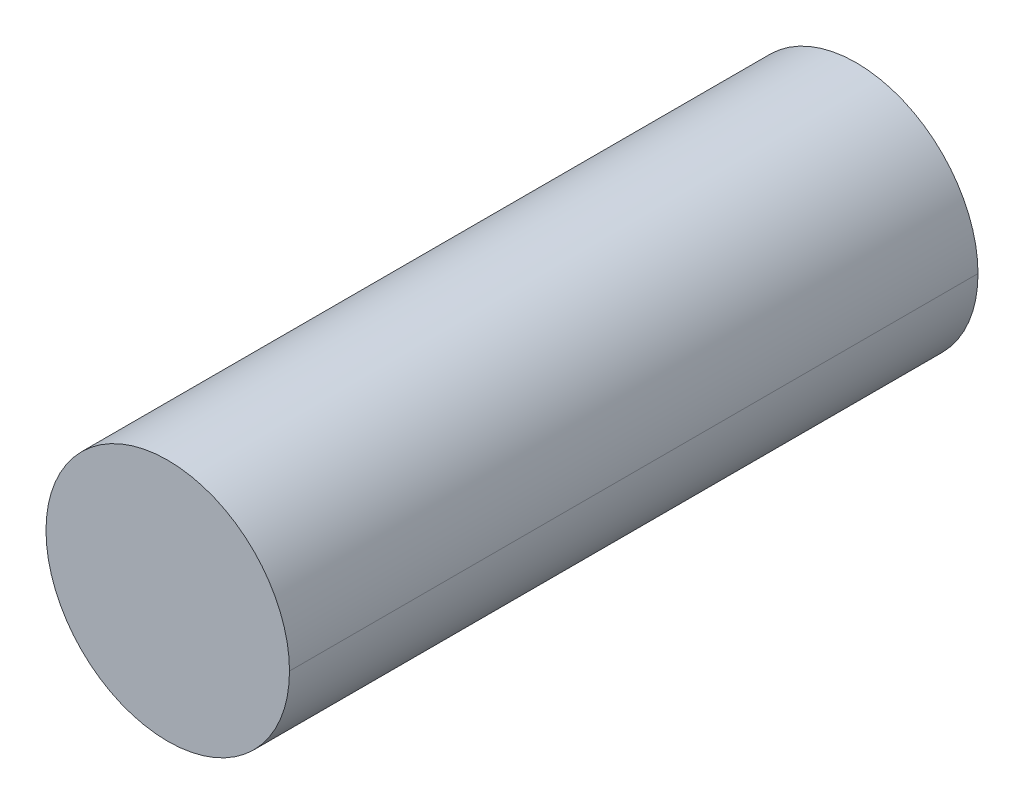
ISO-10303-21;
HEADER;
FILE_DESCRIPTION(('STEP AP214'),'2;1');
FILE_NAME('part.step','',(''),(''),'','','');
FILE_SCHEMA(('AUTOMOTIVE_DESIGN { 1 0 10303 214 1 1 1 1 }'));
ENDSEC;
DATA;
#1=APPLICATION_CONTEXT('core data for automotive mechanical design processes');
#2=APPLICATION_PROTOCOL_DEFINITION('international standard','automotive_design',2000,#1);
#3=PRODUCT_CONTEXT('',#1,'mechanical');
#4=PRODUCT('Part','Part','',(#3));
#5=PRODUCT_RELATED_PRODUCT_CATEGORY('part','',(#4));
#6=PRODUCT_DEFINITION_FORMATION('','',#4);
#7=PRODUCT_DEFINITION_CONTEXT('part definition',#1,'design');
#8=PRODUCT_DEFINITION('design','',#6,#7);
#9=PRODUCT_DEFINITION_SHAPE('','',#8);
#10=(LENGTH_UNIT() NAMED_UNIT(*) SI_UNIT(.MILLI.,.METRE.));
#11=(NAMED_UNIT(*) PLANE_ANGLE_UNIT() SI_UNIT($,.RADIAN.));
#12=(NAMED_UNIT(*) SI_UNIT($,.STERADIAN.) SOLID_ANGLE_UNIT());
#13=UNCERTAINTY_MEASURE_WITH_UNIT(LENGTH_MEASURE(1.E-05),#10,'distance_accuracy_value','');
#14=(GEOMETRIC_REPRESENTATION_CONTEXT(3) GLOBAL_UNCERTAINTY_ASSIGNED_CONTEXT((#13)) GLOBAL_UNIT_ASSIGNED_CONTEXT((#10,
#11,#12)) REPRESENTATION_CONTEXT('',''));
#15=CARTESIAN_POINT('',(0.,0.,0.));
#16=DIRECTION('',(0.,0.,1.));
#17=DIRECTION('',(1.,0.,0.));
#18=AXIS2_PLACEMENT_3D('',#15,#16,#17);
#19=CARTESIAN_POINT('',(0.,0.,0.));
#20=DIRECTION('',(0.,0.,1.));
#21=DIRECTION('',(1.,0.,0.));
#22=AXIS2_PLACEMENT_3D('',#19,#20,#21);
#23=PLANE('',#22);
#24=CARTESIAN_POINT('',(0.,0.,0.));
#25=DIRECTION('',(0.,0.,1.));
#26=DIRECTION('',(1.,0.,0.));
#27=AXIS2_PLACEMENT_3D('',#24,#25,#26);
#28=CIRCLE('',#27,7.25);
#29=CARTESIAN_POINT('',(-7.25,0.,0.));
#30=VERTEX_POINT('',#29);
#31=CARTESIAN_POINT('',(7.25,0.,0.));
#32=VERTEX_POINT('',#31);
#33=EDGE_CURVE('E9',#30,#32,#28,.T.);
#34=ORIENTED_EDGE('',*,*,#33,.F.);
#35=CARTESIAN_POINT('',(0.,0.,0.));
#36=DIRECTION('',(0.,0.,1.));
#37=DIRECTION('',(1.,0.,0.));
#38=AXIS2_PLACEMENT_3D('',#35,#36,#37);
#39=CIRCLE('',#38,7.25);
#40=EDGE_CURVE('E63',#32,#30,#39,.T.);
#41=ORIENTED_EDGE('',*,*,#40,.F.);
#42=EDGE_LOOP('',(#34,#41));
#43=FACE_BOUND('',#42,.T.);
#44=ADVANCED_FACE('F14',(#43),#23,.F.);
#45=CARTESIAN_POINT('',(0.,0.,41.));
#46=DIRECTION('',(0.,0.,1.));
#47=DIRECTION('',(1.,0.,0.));
#48=AXIS2_PLACEMENT_3D('',#45,#46,#47);
#49=PLANE('',#48);
#50=CARTESIAN_POINT('',(0.,0.,41.));
#51=DIRECTION('',(0.,0.,1.));
#52=DIRECTION('',(1.,0.,0.));
#53=AXIS2_PLACEMENT_3D('',#50,#51,#52);
#54=CIRCLE('',#53,7.25);
#55=CARTESIAN_POINT('',(-7.25,0.,41.));
#56=VERTEX_POINT('',#55);
#57=CARTESIAN_POINT('',(7.25,0.,41.));
#58=VERTEX_POINT('',#57);
#59=EDGE_CURVE('E18',#56,#58,#54,.T.);
#60=ORIENTED_EDGE('',*,*,#59,.T.);
#61=CARTESIAN_POINT('',(0.,0.,41.));
#62=DIRECTION('',(0.,0.,1.));
#63=DIRECTION('',(1.,0.,0.));
#64=AXIS2_PLACEMENT_3D('',#61,#62,#63);
#65=CIRCLE('',#64,7.25);
#66=EDGE_CURVE('E54',#58,#56,#65,.T.);
#67=ORIENTED_EDGE('',*,*,#66,.T.);
#68=EDGE_LOOP('',(#60,#67));
#69=FACE_BOUND('',#68,.T.);
#70=ADVANCED_FACE('F16',(#69),#49,.T.);
#71=CARTESIAN_POINT('',(0.,0.,41.));
#72=DIRECTION('',(0.,0.,-1.));
#73=DIRECTION('',(-1.,0.,0.));
#74=AXIS2_PLACEMENT_3D('',#71,#72,#73);
#75=CYLINDRICAL_SURFACE('',#74,7.25);
#76=DIRECTION('',(0.,0.,-1.));
#77=VECTOR('',#76,1.);
#78=CARTESIAN_POINT('',(7.25,0.,41.));
#79=LINE('',#78,#77);
#80=EDGE_CURVE('E58',#58,#32,#79,.T.);
#81=ORIENTED_EDGE('',*,*,#80,.F.);
#82=ORIENTED_EDGE('',*,*,#59,.F.);
#83=DIRECTION('',(0.,0.,-1.));
#84=VECTOR('',#83,1.);
#85=CARTESIAN_POINT('',(-7.25,0.,41.));
#86=LINE('',#85,#84);
#87=EDGE_CURVE('E56',#56,#30,#86,.T.);
#88=ORIENTED_EDGE('',*,*,#87,.T.);
#89=ORIENTED_EDGE('',*,*,#33,.T.);
#90=EDGE_LOOP('',(#81,#82,#88,#89));
#91=FACE_BOUND('',#90,.T.);
#92=ADVANCED_FACE('F59',(#91),#75,.T.);
#93=CARTESIAN_POINT('',(0.,0.,41.));
#94=DIRECTION('',(0.,0.,-1.));
#95=DIRECTION('',(-1.,0.,0.));
#96=AXIS2_PLACEMENT_3D('',#93,#94,#95);
#97=CYLINDRICAL_SURFACE('',#96,7.25);
#98=ORIENTED_EDGE('',*,*,#66,.F.);
#99=ORIENTED_EDGE('',*,*,#80,.T.);
#100=ORIENTED_EDGE('',*,*,#40,.T.);
#101=ORIENTED_EDGE('',*,*,#87,.F.);
#102=EDGE_LOOP('',(#98,#99,#100,#101));
#103=FACE_BOUND('',#102,.T.);
#104=ADVANCED_FACE('F65',(#103),#97,.T.);
#105=CLOSED_SHELL('',(#44,#70,#92,#104));
#106=MANIFOLD_SOLID_BREP('B1',#105);
#107=ADVANCED_BREP_SHAPE_REPRESENTATION('',(#18,#106),#14);
#108=SHAPE_DEFINITION_REPRESENTATION(#9,#107);
ENDSEC;
END-ISO-10303-21;
